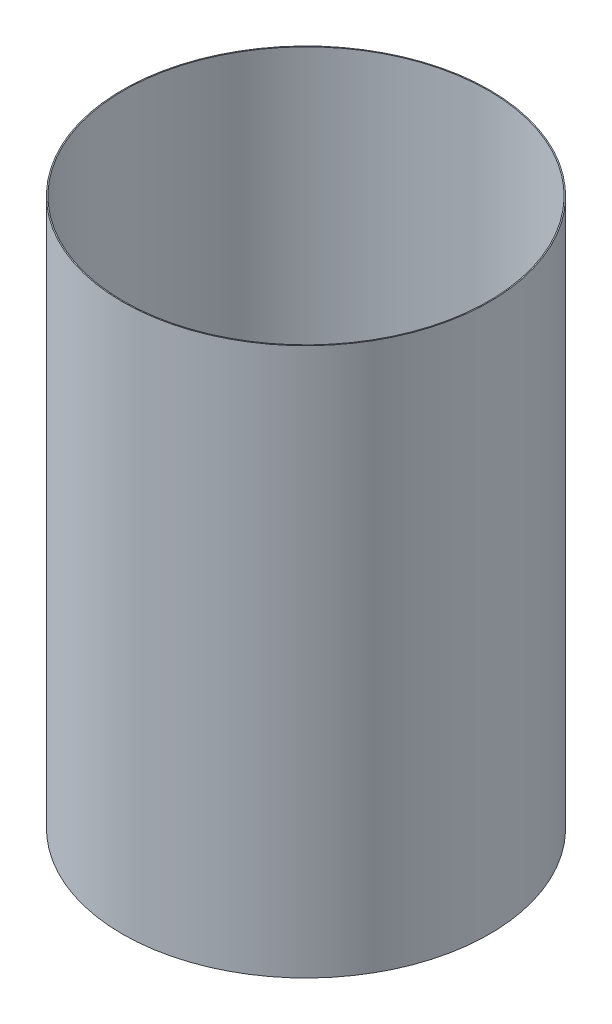
ISO-10303-21;
HEADER;
FILE_DESCRIPTION(('STEP AP214'),'2;1');
FILE_NAME('part.step','',(''),(''),'','','');
FILE_SCHEMA(('AUTOMOTIVE_DESIGN { 1 0 10303 214 1 1 1 1 }'));
ENDSEC;
DATA;
#1=APPLICATION_CONTEXT('core data for automotive mechanical design processes');
#2=APPLICATION_PROTOCOL_DEFINITION('international standard','automotive_design',2000,#1);
#3=PRODUCT_CONTEXT('',#1,'mechanical');
#4=PRODUCT('Part','Part','',(#3));
#5=PRODUCT_RELATED_PRODUCT_CATEGORY('part','',(#4));
#6=PRODUCT_DEFINITION_FORMATION('','',#4);
#7=PRODUCT_DEFINITION_CONTEXT('part definition',#1,'design');
#8=PRODUCT_DEFINITION('design','',#6,#7);
#9=PRODUCT_DEFINITION_SHAPE('','',#8);
#10=(LENGTH_UNIT() NAMED_UNIT(*) SI_UNIT(.MILLI.,.METRE.));
#11=(NAMED_UNIT(*) PLANE_ANGLE_UNIT() SI_UNIT($,.RADIAN.));
#12=(NAMED_UNIT(*) SI_UNIT($,.STERADIAN.) SOLID_ANGLE_UNIT());
#13=UNCERTAINTY_MEASURE_WITH_UNIT(LENGTH_MEASURE(1.E-05),#10,'distance_accuracy_value','');
#14=(GEOMETRIC_REPRESENTATION_CONTEXT(3) GLOBAL_UNCERTAINTY_ASSIGNED_CONTEXT((#13)) GLOBAL_UNIT_ASSIGNED_CONTEXT((#10,
#11,#12)) REPRESENTATION_CONTEXT('',''));
#15=CARTESIAN_POINT('',(0.,0.,0.));
#16=DIRECTION('',(0.,0.,1.));
#17=DIRECTION('',(1.,0.,0.));
#18=AXIS2_PLACEMENT_3D('',#15,#16,#17);
#19=CARTESIAN_POINT('',(0.,55.,0.));
#20=DIRECTION('',(0.,1.,0.));
#21=DIRECTION('',(0.,0.,1.));
#22=AXIS2_PLACEMENT_3D('',#19,#20,#21);
#23=CYLINDRICAL_SURFACE('',#22,44.704);
#24=CARTESIAN_POINT('',(0.,-202.353193409573,0.));
#25=DIRECTION('',(0.,1.,0.));
#26=DIRECTION('',(0.,0.,1.));
#27=AXIS2_PLACEMENT_3D('',#24,#25,#26);
#28=CIRCLE('',#27,44.704);
#29=CARTESIAN_POINT('',(0.,-202.353193409573,44.704));
#30=VERTEX_POINT('',#29);
#31=EDGE_CURVE('E44',#30,#30,#28,.T.);
#32=ORIENTED_EDGE('',*,*,#31,.T.);
#33=EDGE_LOOP('',(#32));
#34=FACE_BOUND('',#33,.T.);
#35=CARTESIAN_POINT('',(0.,-69.0031934095732,0.));
#36=DIRECTION('',(0.,1.,0.));
#37=DIRECTION('',(0.,0.,1.));
#38=AXIS2_PLACEMENT_3D('',#35,#36,#37);
#39=CIRCLE('',#38,44.704);
#40=CARTESIAN_POINT('',(0.,-69.0031934095732,44.704));
#41=VERTEX_POINT('',#40);
#42=EDGE_CURVE('E10',#41,#41,#39,.T.);
#43=ORIENTED_EDGE('',*,*,#42,.F.);
#44=EDGE_LOOP('',(#43));
#45=FACE_BOUND('',#44,.T.);
#46=ADVANCED_FACE('F30',(#34,#45),#23,.T.);
#47=CARTESIAN_POINT('',(-44.704,-69.0031934095732,0.));
#48=DIRECTION('',(0.,-1.,0.));
#49=DIRECTION('',(0.,0.,-1.));
#50=AXIS2_PLACEMENT_3D('',#47,#48,#49);
#51=PLANE('',#50);
#52=CARTESIAN_POINT('',(0.,-69.0031934095732,0.));
#53=DIRECTION('',(0.,1.,0.));
#54=DIRECTION('',(0.,0.,1.));
#55=AXIS2_PLACEMENT_3D('',#52,#53,#54);
#56=CIRCLE('',#55,44.45);
#57=CARTESIAN_POINT('',(0.,-69.0031934095732,44.45));
#58=VERTEX_POINT('',#57);
#59=EDGE_CURVE('E36',#58,#58,#56,.T.);
#60=ORIENTED_EDGE('',*,*,#59,.F.);
#61=EDGE_LOOP('',(#60));
#62=FACE_BOUND('',#61,.T.);
#63=ORIENTED_EDGE('',*,*,#42,.T.);
#64=EDGE_LOOP('',(#63));
#65=FACE_BOUND('',#64,.T.);
#66=ADVANCED_FACE('F60',(#62,#65),#51,.F.);
#67=CARTESIAN_POINT('',(0.,55.,0.));
#68=DIRECTION('',(0.,1.,0.));
#69=DIRECTION('',(0.,0.,1.));
#70=AXIS2_PLACEMENT_3D('',#67,#68,#69);
#71=CYLINDRICAL_SURFACE('',#70,44.45);
#72=CARTESIAN_POINT('',(0.,-202.353193409573,0.));
#73=DIRECTION('',(0.,1.,0.));
#74=DIRECTION('',(0.,0.,1.));
#75=AXIS2_PLACEMENT_3D('',#72,#73,#74);
#76=CIRCLE('',#75,44.45);
#77=CARTESIAN_POINT('',(0.,-202.353193409573,44.45));
#78=VERTEX_POINT('',#77);
#79=EDGE_CURVE('E40',#78,#78,#76,.T.);
#80=ORIENTED_EDGE('',*,*,#79,.F.);
#81=EDGE_LOOP('',(#80));
#82=FACE_BOUND('',#81,.T.);
#83=ORIENTED_EDGE('',*,*,#59,.T.);
#84=EDGE_LOOP('',(#83));
#85=FACE_BOUND('',#84,.T.);
#86=ADVANCED_FACE('F55',(#82,#85),#71,.F.);
#87=CARTESIAN_POINT('',(-44.45,-202.353193409573,0.));
#88=DIRECTION('',(0.,1.,0.));
#89=DIRECTION('',(0.,0.,1.));
#90=AXIS2_PLACEMENT_3D('',#87,#88,#89);
#91=PLANE('',#90);
#92=ORIENTED_EDGE('',*,*,#31,.F.);
#93=EDGE_LOOP('',(#92));
#94=FACE_BOUND('',#93,.T.);
#95=ORIENTED_EDGE('',*,*,#79,.T.);
#96=EDGE_LOOP('',(#95));
#97=FACE_BOUND('',#96,.T.);
#98=ADVANCED_FACE('F52',(#94,#97),#91,.F.);
#99=CLOSED_SHELL('',(#46,#66,#86,#98));
#100=MANIFOLD_SOLID_BREP('B2',#99);
#101=ADVANCED_BREP_SHAPE_REPRESENTATION('',(#18,#100),#14);
#102=SHAPE_DEFINITION_REPRESENTATION(#9,#101);
ENDSEC;
END-ISO-10303-21;
